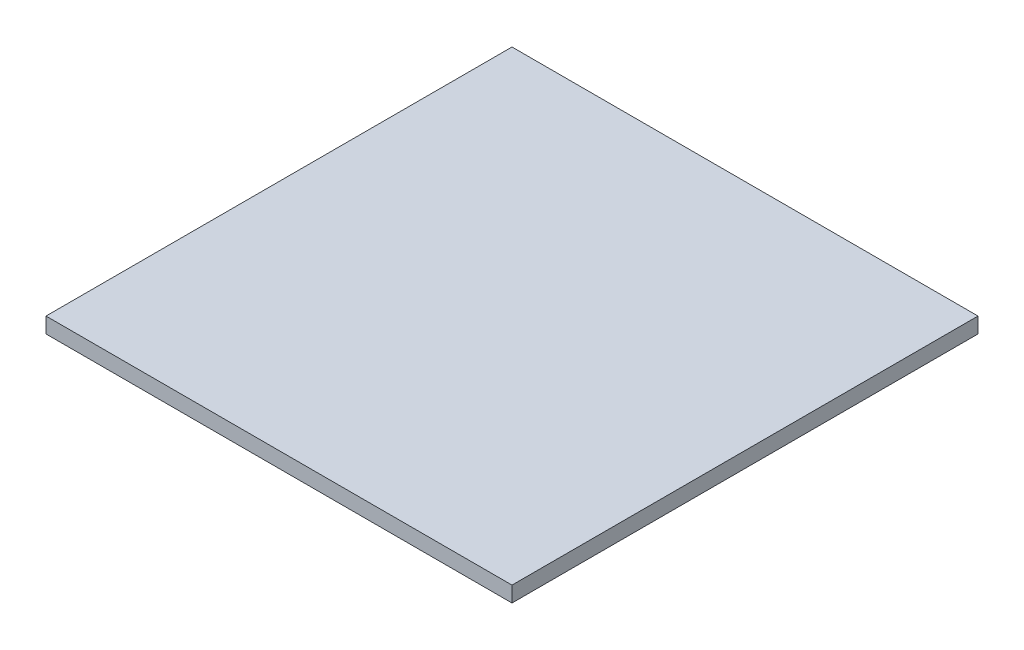
ISO-10303-21;
HEADER;
FILE_DESCRIPTION(('STEP AP214'),'2;1');
FILE_NAME('part.step','',(''),(''),'','','');
FILE_SCHEMA(('AUTOMOTIVE_DESIGN { 1 0 10303 214 1 1 1 1 }'));
ENDSEC;
DATA;
#1=APPLICATION_CONTEXT('core data for automotive mechanical design processes');
#2=APPLICATION_PROTOCOL_DEFINITION('international standard','automotive_design',2000,#1);
#3=PRODUCT_CONTEXT('',#1,'mechanical');
#4=PRODUCT('Part','Part','',(#3));
#5=PRODUCT_RELATED_PRODUCT_CATEGORY('part','',(#4));
#6=PRODUCT_DEFINITION_FORMATION('','',#4);
#7=PRODUCT_DEFINITION_CONTEXT('part definition',#1,'design');
#8=PRODUCT_DEFINITION('design','',#6,#7);
#9=PRODUCT_DEFINITION_SHAPE('','',#8);
#10=(LENGTH_UNIT() NAMED_UNIT(*) SI_UNIT(.MILLI.,.METRE.));
#11=(NAMED_UNIT(*) PLANE_ANGLE_UNIT() SI_UNIT($,.RADIAN.));
#12=(NAMED_UNIT(*) SI_UNIT($,.STERADIAN.) SOLID_ANGLE_UNIT());
#13=UNCERTAINTY_MEASURE_WITH_UNIT(LENGTH_MEASURE(1.E-05),#10,'distance_accuracy_value','');
#14=(GEOMETRIC_REPRESENTATION_CONTEXT(3) GLOBAL_UNCERTAINTY_ASSIGNED_CONTEXT((#13)) GLOBAL_UNIT_ASSIGNED_CONTEXT((#10,
#11,#12)) REPRESENTATION_CONTEXT('',''));
#15=CARTESIAN_POINT('',(0.,0.,0.));
#16=DIRECTION('',(0.,0.,1.));
#17=DIRECTION('',(1.,0.,0.));
#18=AXIS2_PLACEMENT_3D('',#15,#16,#17);
#19=CARTESIAN_POINT('',(-46.1460101867572,3.,-35.9083191850594));
#20=DIRECTION('',(1.,0.,0.));
#21=DIRECTION('',(0.,0.,-1.));
#22=AXIS2_PLACEMENT_3D('',#19,#20,#21);
#23=PLANE('',#22);
#24=DIRECTION('',(0.,0.,1.));
#25=VECTOR('',#24,1.);
#26=CARTESIAN_POINT('',(-46.1460101867572,0.,-35.9083191850594));
#27=LINE('',#26,#25);
#28=CARTESIAN_POINT('',(-46.1460101867572,0.,-35.9083191850594));
#29=VERTEX_POINT('',#28);
#30=CARTESIAN_POINT('',(-46.1460101867572,0.,54.0916808149406));
#31=VERTEX_POINT('',#30);
#32=EDGE_CURVE('E109',#29,#31,#27,.T.);
#33=ORIENTED_EDGE('',*,*,#32,.T.);
#34=DIRECTION('',(0.,-1.,0.));
#35=VECTOR('',#34,1.);
#36=CARTESIAN_POINT('',(-46.1460101867572,3.,54.0916808149406));
#37=LINE('',#36,#35);
#38=CARTESIAN_POINT('',(-46.1460101867572,3.,54.0916808149406));
#39=VERTEX_POINT('',#38);
#40=EDGE_CURVE('E11',#39,#31,#37,.T.);
#41=ORIENTED_EDGE('',*,*,#40,.F.);
#42=DIRECTION('',(0.,0.,1.));
#43=VECTOR('',#42,1.);
#44=CARTESIAN_POINT('',(-46.1460101867572,3.,-35.9083191850594));
#45=LINE('',#44,#43);
#46=CARTESIAN_POINT('',(-46.1460101867572,3.,-35.9083191850594));
#47=VERTEX_POINT('',#46);
#48=EDGE_CURVE('E93',#47,#39,#45,.T.);
#49=ORIENTED_EDGE('',*,*,#48,.F.);
#50=DIRECTION('',(0.,-1.,0.));
#51=VECTOR('',#50,1.);
#52=CARTESIAN_POINT('',(-46.1460101867572,3.,-35.9083191850594));
#53=LINE('',#52,#51);
#54=EDGE_CURVE('E105',#47,#29,#53,.T.);
#55=ORIENTED_EDGE('',*,*,#54,.T.);
#56=EDGE_LOOP('',(#33,#41,#49,#55));
#57=FACE_BOUND('',#56,.T.);
#58=ADVANCED_FACE('F41',(#57),#23,.F.);
#59=CARTESIAN_POINT('',(-46.1460101867572,3.,54.0916808149406));
#60=DIRECTION('',(0.,0.,-1.));
#61=DIRECTION('',(-1.,0.,0.));
#62=AXIS2_PLACEMENT_3D('',#59,#60,#61);
#63=PLANE('',#62);
#64=DIRECTION('',(1.,0.,0.));
#65=VECTOR('',#64,1.);
#66=CARTESIAN_POINT('',(-46.1460101867572,0.,54.0916808149406));
#67=LINE('',#66,#65);
#68=CARTESIAN_POINT('',(43.8539898132428,0.,54.0916808149406));
#69=VERTEX_POINT('',#68);
#70=EDGE_CURVE('E98',#31,#69,#67,.T.);
#71=ORIENTED_EDGE('',*,*,#70,.T.);
#72=DIRECTION('',(0.,-1.,0.));
#73=VECTOR('',#72,1.);
#74=CARTESIAN_POINT('',(43.8539898132428,3.,54.0916808149406));
#75=LINE('',#74,#73);
#76=CARTESIAN_POINT('',(43.8539898132428,3.,54.0916808149406));
#77=VERTEX_POINT('',#76);
#78=EDGE_CURVE('E50',#77,#69,#75,.T.);
#79=ORIENTED_EDGE('',*,*,#78,.F.);
#80=DIRECTION('',(1.,0.,0.));
#81=VECTOR('',#80,1.);
#82=CARTESIAN_POINT('',(-46.1460101867572,3.,54.0916808149406));
#83=LINE('',#82,#81);
#84=EDGE_CURVE('E88',#39,#77,#83,.T.);
#85=ORIENTED_EDGE('',*,*,#84,.F.);
#86=ORIENTED_EDGE('',*,*,#40,.T.);
#87=EDGE_LOOP('',(#71,#79,#85,#86));
#88=FACE_BOUND('',#87,.T.);
#89=ADVANCED_FACE('F97',(#88),#63,.F.);
#90=CARTESIAN_POINT('',(43.8539898132428,3.,-35.9083191850594));
#91=DIRECTION('',(-1.,0.,0.));
#92=DIRECTION('',(0.,0.,1.));
#93=AXIS2_PLACEMENT_3D('',#90,#91,#92);
#94=PLANE('',#93);
#95=DIRECTION('',(0.,0.,-1.));
#96=VECTOR('',#95,1.);
#97=CARTESIAN_POINT('',(43.8539898132428,0.,-35.9083191850594));
#98=LINE('',#97,#96);
#99=CARTESIAN_POINT('',(43.8539898132428,0.,-35.9083191850594));
#100=VERTEX_POINT('',#99);
#101=EDGE_CURVE('E75',#69,#100,#98,.T.);
#102=ORIENTED_EDGE('',*,*,#101,.T.);
#103=DIRECTION('',(0.,-1.,0.));
#104=VECTOR('',#103,1.);
#105=CARTESIAN_POINT('',(43.8539898132428,3.,-35.9083191850594));
#106=LINE('',#105,#104);
#107=CARTESIAN_POINT('',(43.8539898132428,3.,-35.9083191850594));
#108=VERTEX_POINT('',#107);
#109=EDGE_CURVE('E100',#108,#100,#106,.T.);
#110=ORIENTED_EDGE('',*,*,#109,.F.);
#111=DIRECTION('',(0.,0.,-1.));
#112=VECTOR('',#111,1.);
#113=CARTESIAN_POINT('',(43.8539898132428,3.,-35.9083191850594));
#114=LINE('',#113,#112);
#115=EDGE_CURVE('E91',#77,#108,#114,.T.);
#116=ORIENTED_EDGE('',*,*,#115,.F.);
#117=ORIENTED_EDGE('',*,*,#78,.T.);
#118=EDGE_LOOP('',(#102,#110,#116,#117));
#119=FACE_BOUND('',#118,.T.);
#120=ADVANCED_FACE('F101',(#119),#94,.F.);
#121=CARTESIAN_POINT('',(-46.1460101867572,3.,-35.9083191850594));
#122=DIRECTION('',(0.,0.,1.));
#123=DIRECTION('',(1.,0.,0.));
#124=AXIS2_PLACEMENT_3D('',#121,#122,#123);
#125=PLANE('',#124);
#126=DIRECTION('',(-1.,0.,0.));
#127=VECTOR('',#126,1.);
#128=CARTESIAN_POINT('',(-46.1460101867572,0.,-35.9083191850594));
#129=LINE('',#128,#127);
#130=EDGE_CURVE('E81',#100,#29,#129,.T.);
#131=ORIENTED_EDGE('',*,*,#130,.T.);
#132=ORIENTED_EDGE('',*,*,#54,.F.);
#133=DIRECTION('',(-1.,0.,0.));
#134=VECTOR('',#133,1.);
#135=CARTESIAN_POINT('',(-46.1460101867572,3.,-35.9083191850594));
#136=LINE('',#135,#134);
#137=EDGE_CURVE('E58',#108,#47,#136,.T.);
#138=ORIENTED_EDGE('',*,*,#137,.F.);
#139=ORIENTED_EDGE('',*,*,#109,.T.);
#140=EDGE_LOOP('',(#131,#132,#138,#139));
#141=FACE_BOUND('',#140,.T.);
#142=ADVANCED_FACE('F122',(#141),#125,.F.);
#143=CARTESIAN_POINT('',(0.,3.,0.));
#144=DIRECTION('',(0.,1.,0.));
#145=DIRECTION('',(0.,0.,1.));
#146=AXIS2_PLACEMENT_3D('',#143,#144,#145);
#147=PLANE('',#146);
#148=ORIENTED_EDGE('',*,*,#48,.T.);
#149=ORIENTED_EDGE('',*,*,#84,.T.);
#150=ORIENTED_EDGE('',*,*,#115,.T.);
#151=ORIENTED_EDGE('',*,*,#137,.T.);
#152=EDGE_LOOP('',(#148,#149,#150,#151));
#153=FACE_BOUND('',#152,.T.);
#154=ADVANCED_FACE('F89',(#153),#147,.T.);
#155=CARTESIAN_POINT('',(0.,0.,0.));
#156=DIRECTION('',(0.,1.,0.));
#157=DIRECTION('',(0.,0.,1.));
#158=AXIS2_PLACEMENT_3D('',#155,#156,#157);
#159=PLANE('',#158);
#160=ORIENTED_EDGE('',*,*,#32,.F.);
#161=ORIENTED_EDGE('',*,*,#130,.F.);
#162=ORIENTED_EDGE('',*,*,#101,.F.);
#163=ORIENTED_EDGE('',*,*,#70,.F.);
#164=EDGE_LOOP('',(#160,#161,#162,#163));
#165=FACE_BOUND('',#164,.T.);
#166=ADVANCED_FACE('F125',(#165),#159,.F.);
#167=CLOSED_SHELL('',(#58,#89,#120,#142,#154,#166));
#168=MANIFOLD_SOLID_BREP('B2',#167);
#169=ADVANCED_BREP_SHAPE_REPRESENTATION('',(#18,#168),#14);
#170=SHAPE_DEFINITION_REPRESENTATION(#9,#169);
ENDSEC;
END-ISO-10303-21;
